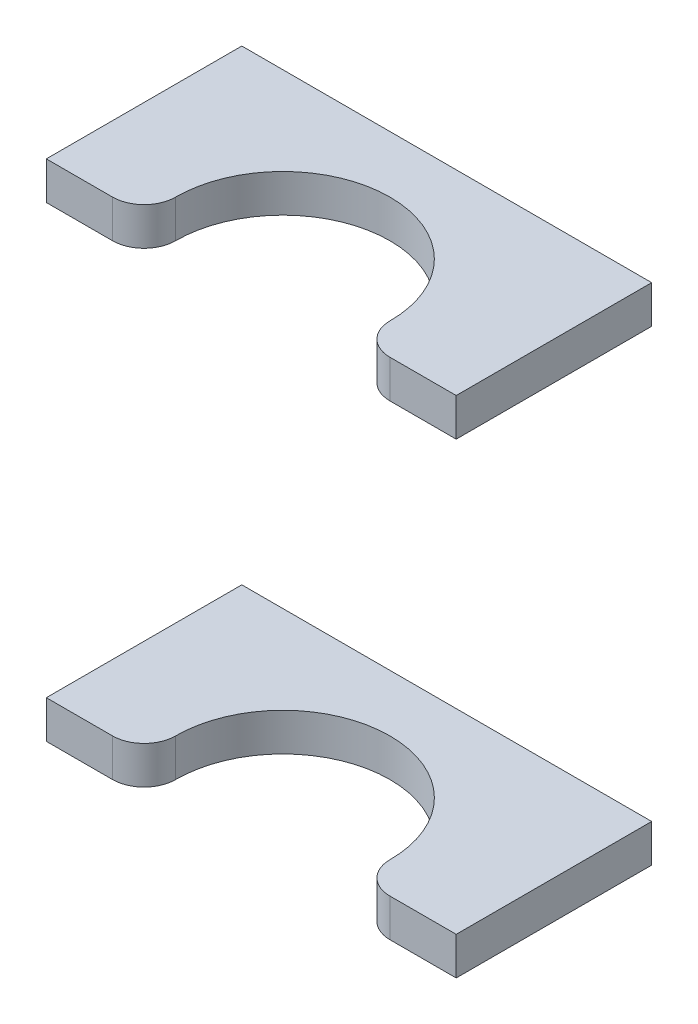
ISO-10303-21;
HEADER;
FILE_DESCRIPTION(('STEP AP214'),'2;1');
FILE_NAME('part.step','',(''),(''),'','','');
FILE_SCHEMA(('AUTOMOTIVE_DESIGN { 1 0 10303 214 1 1 1 1 }'));
ENDSEC;
DATA;
#1=APPLICATION_CONTEXT('core data for automotive mechanical design processes');
#2=APPLICATION_PROTOCOL_DEFINITION('international standard','automotive_design',2000,#1);
#3=PRODUCT_CONTEXT('',#1,'mechanical');
#4=PRODUCT('Part','Part','',(#3));
#5=PRODUCT_RELATED_PRODUCT_CATEGORY('part','',(#4));
#6=PRODUCT_DEFINITION_FORMATION('','',#4);
#7=PRODUCT_DEFINITION_CONTEXT('part definition',#1,'design');
#8=PRODUCT_DEFINITION('design','',#6,#7);
#9=PRODUCT_DEFINITION_SHAPE('','',#8);
#10=(LENGTH_UNIT() NAMED_UNIT(*) SI_UNIT(.MILLI.,.METRE.));
#11=(NAMED_UNIT(*) PLANE_ANGLE_UNIT() SI_UNIT($,.RADIAN.));
#12=(NAMED_UNIT(*) SI_UNIT($,.STERADIAN.) SOLID_ANGLE_UNIT());
#13=UNCERTAINTY_MEASURE_WITH_UNIT(LENGTH_MEASURE(1.E-05),#10,'distance_accuracy_value','');
#14=(GEOMETRIC_REPRESENTATION_CONTEXT(3) GLOBAL_UNCERTAINTY_ASSIGNED_CONTEXT((#13)) GLOBAL_UNIT_ASSIGNED_CONTEXT((#10,
#11,#12)) REPRESENTATION_CONTEXT('',''));
#15=CARTESIAN_POINT('',(0.,0.,0.));
#16=DIRECTION('',(0.,0.,1.));
#17=DIRECTION('',(1.,0.,0.));
#18=AXIS2_PLACEMENT_3D('',#15,#16,#17);
#19=CARTESIAN_POINT('',(-315.,100.,111.27633568147));
#20=DIRECTION('',(-1.,0.,0.));
#21=DIRECTION('',(0.,0.,1.));
#22=AXIS2_PLACEMENT_3D('',#19,#20,#21);
#23=PLANE('',#22);
#24=DIRECTION('',(0.,0.,-1.));
#25=VECTOR('',#24,1.);
#26=CARTESIAN_POINT('',(-315.,100.,111.27633568147));
#27=LINE('',#26,#25);
#28=CARTESIAN_POINT('',(-315.,100.,30.9999999999993));
#29=VERTEX_POINT('',#28);
#30=CARTESIAN_POINT('',(-315.,100.,0.));
#31=VERTEX_POINT('',#30);
#32=EDGE_CURVE('E86',#29,#31,#27,.T.);
#33=ORIENTED_EDGE('',*,*,#32,.F.);
#34=DIRECTION('',(0.,-1.,0.));
#35=VECTOR('',#34,1.);
#36=CARTESIAN_POINT('',(-315.,100.,30.9999999999993));
#37=LINE('',#36,#35);
#38=CARTESIAN_POINT('',(-315.,94.,30.9999999999993));
#39=VERTEX_POINT('',#38);
#40=EDGE_CURVE('E139',#29,#39,#37,.T.);
#41=ORIENTED_EDGE('',*,*,#40,.T.);
#42=DIRECTION('',(0.,0.,-1.));
#43=VECTOR('',#42,1.);
#44=CARTESIAN_POINT('',(-315.,94.,111.27633568147));
#45=LINE('',#44,#43);
#46=CARTESIAN_POINT('',(-315.,94.,0.));
#47=VERTEX_POINT('',#46);
#48=EDGE_CURVE('E94',#39,#47,#45,.T.);
#49=ORIENTED_EDGE('',*,*,#48,.T.);
#50=DIRECTION('',(0.,1.,0.));
#51=VECTOR('',#50,1.);
#52=CARTESIAN_POINT('',(-315.,100.,0.));
#53=LINE('',#52,#51);
#54=EDGE_CURVE('E190',#47,#31,#53,.T.);
#55=ORIENTED_EDGE('',*,*,#54,.T.);
#56=EDGE_LOOP('',(#33,#41,#49,#55));
#57=FACE_BOUND('',#56,.T.);
#58=ADVANCED_FACE('F50',(#57),#23,.F.);
#59=CARTESIAN_POINT('',(-315.,100.,111.27633568147));
#60=DIRECTION('',(0.,-1.,0.));
#61=DIRECTION('',(0.,0.,-1.));
#62=AXIS2_PLACEMENT_3D('',#59,#60,#61);
#63=PLANE('',#62);
#64=DIRECTION('',(0.,0.,-1.));
#65=VECTOR('',#64,1.);
#66=CARTESIAN_POINT('',(-380.,100.,111.27633568147));
#67=LINE('',#66,#65);
#68=CARTESIAN_POINT('',(-380.,100.,30.9999999999993));
#69=VERTEX_POINT('',#68);
#70=CARTESIAN_POINT('',(-380.,100.,0.));
#71=VERTEX_POINT('',#70);
#72=EDGE_CURVE('E186',#69,#71,#67,.T.);
#73=ORIENTED_EDGE('',*,*,#72,.F.);
#74=DIRECTION('',(1.,0.,0.));
#75=VECTOR('',#74,1.);
#76=CARTESIAN_POINT('',(-369.5,100.,30.9999999999995));
#77=LINE('',#76,#75);
#78=CARTESIAN_POINT('',(-369.5,100.,30.9999999999995));
#79=VERTEX_POINT('',#78);
#80=EDGE_CURVE('E145',#69,#79,#77,.T.);
#81=ORIENTED_EDGE('',*,*,#80,.T.);
#82=CARTESIAN_POINT('',(-369.5,100.,25.9999999999994));
#83=DIRECTION('',(0.,1.,0.));
#84=DIRECTION('',(1.,0.,0.));
#85=AXIS2_PLACEMENT_3D('',#82,#83,#84);
#86=CIRCLE('',#85,4.99999999999998);
#87=CARTESIAN_POINT('',(-364.5,100.,25.9999999999994));
#88=VERTEX_POINT('',#87);
#89=EDGE_CURVE('E159',#79,#88,#86,.T.);
#90=ORIENTED_EDGE('',*,*,#89,.T.);
#91=CARTESIAN_POINT('',(-347.5,100.,25.9999999999994));
#92=DIRECTION('',(0.,-1.,0.));
#93=DIRECTION('',(1.,0.,0.));
#94=AXIS2_PLACEMENT_3D('',#91,#92,#93);
#95=CIRCLE('',#94,17.);
#96=CARTESIAN_POINT('',(-330.5,100.,25.9999999999994));
#97=VERTEX_POINT('',#96);
#98=EDGE_CURVE('E140',#88,#97,#95,.T.);
#99=ORIENTED_EDGE('',*,*,#98,.T.);
#100=CARTESIAN_POINT('',(-325.5,100.,25.9999999999994));
#101=DIRECTION('',(0.,1.,0.));
#102=DIRECTION('',(-1.,0.,0.));
#103=AXIS2_PLACEMENT_3D('',#100,#101,#102);
#104=CIRCLE('',#103,4.99999999999998);
#105=CARTESIAN_POINT('',(-325.5,100.,30.9999999999995));
#106=VERTEX_POINT('',#105);
#107=EDGE_CURVE('E133',#97,#106,#104,.T.);
#108=ORIENTED_EDGE('',*,*,#107,.T.);
#109=DIRECTION('',(1.,0.,0.));
#110=VECTOR('',#109,1.);
#111=CARTESIAN_POINT('',(-325.5,100.,30.9999999999995));
#112=LINE('',#111,#110);
#113=EDGE_CURVE('E142',#106,#29,#112,.T.);
#114=ORIENTED_EDGE('',*,*,#113,.T.);
#115=ORIENTED_EDGE('',*,*,#32,.T.);
#116=DIRECTION('',(-1.,0.,0.));
#117=VECTOR('',#116,1.);
#118=CARTESIAN_POINT('',(-315.,100.,0.));
#119=LINE('',#118,#117);
#120=EDGE_CURVE('E187',#31,#71,#119,.T.);
#121=ORIENTED_EDGE('',*,*,#120,.T.);
#122=EDGE_LOOP('',(#73,#81,#90,#99,#108,#114,#115,#121));
#123=FACE_BOUND('',#122,.T.);
#124=ADVANCED_FACE('F148',(#123),#63,.F.);
#125=CARTESIAN_POINT('',(-380.,100.,111.27633568147));
#126=DIRECTION('',(1.,0.,0.));
#127=DIRECTION('',(0.,1.,0.));
#128=AXIS2_PLACEMENT_3D('',#125,#126,#127);
#129=PLANE('',#128);
#130=DIRECTION('',(0.,0.,-1.));
#131=VECTOR('',#130,1.);
#132=CARTESIAN_POINT('',(-380.,94.,111.27633568147));
#133=LINE('',#132,#131);
#134=CARTESIAN_POINT('',(-380.,94.,30.9999999999993));
#135=VERTEX_POINT('',#134);
#136=CARTESIAN_POINT('',(-380.,94.,0.));
#137=VERTEX_POINT('',#136);
#138=EDGE_CURVE('E73',#135,#137,#133,.T.);
#139=ORIENTED_EDGE('',*,*,#138,.F.);
#140=DIRECTION('',(0.,-1.,0.));
#141=VECTOR('',#140,1.);
#142=CARTESIAN_POINT('',(-380.,100.,30.9999999999993));
#143=LINE('',#142,#141);
#144=EDGE_CURVE('E174',#69,#135,#143,.T.);
#145=ORIENTED_EDGE('',*,*,#144,.F.);
#146=ORIENTED_EDGE('',*,*,#72,.T.);
#147=DIRECTION('',(0.,-1.,0.));
#148=VECTOR('',#147,1.);
#149=CARTESIAN_POINT('',(-380.,100.,0.));
#150=LINE('',#149,#148);
#151=EDGE_CURVE('E183',#71,#137,#150,.T.);
#152=ORIENTED_EDGE('',*,*,#151,.T.);
#153=EDGE_LOOP('',(#139,#145,#146,#152));
#154=FACE_BOUND('',#153,.T.);
#155=ADVANCED_FACE('F215',(#154),#129,.F.);
#156=CARTESIAN_POINT('',(-315.,94.,111.27633568147));
#157=DIRECTION('',(0.,1.,0.));
#158=DIRECTION('',(-1.,0.,0.));
#159=AXIS2_PLACEMENT_3D('',#156,#157,#158);
#160=PLANE('',#159);
#161=CARTESIAN_POINT('',(-369.5,94.,25.9999999999994));
#162=DIRECTION('',(0.,1.,0.));
#163=DIRECTION('',(-1.,0.,0.));
#164=AXIS2_PLACEMENT_3D('',#161,#162,#163);
#165=CIRCLE('',#164,4.99999999999998);
#166=CARTESIAN_POINT('',(-364.5,94.,25.9999999999994));
#167=VERTEX_POINT('',#166);
#168=CARTESIAN_POINT('',(-369.5,94.,30.9999999999995));
#169=VERTEX_POINT('',#168);
#170=EDGE_CURVE('E58',#167,#169,#165,.F.);
#171=ORIENTED_EDGE('',*,*,#170,.T.);
#172=DIRECTION('',(-1.,0.,0.));
#173=VECTOR('',#172,1.);
#174=CARTESIAN_POINT('',(-314.999999999999,94.,31.0000000000001));
#175=LINE('',#174,#173);
#176=EDGE_CURVE('E12',#169,#135,#175,.T.);
#177=ORIENTED_EDGE('',*,*,#176,.T.);
#178=ORIENTED_EDGE('',*,*,#138,.T.);
#179=DIRECTION('',(1.,0.,0.));
#180=VECTOR('',#179,1.);
#181=CARTESIAN_POINT('',(-315.,94.,0.));
#182=LINE('',#181,#180);
#183=EDGE_CURVE('E179',#137,#47,#182,.T.);
#184=ORIENTED_EDGE('',*,*,#183,.T.);
#185=ORIENTED_EDGE('',*,*,#48,.F.);
#186=DIRECTION('',(-1.,0.,0.));
#187=VECTOR('',#186,1.);
#188=CARTESIAN_POINT('',(-315.000000000001,94.,30.9999999999993));
#189=LINE('',#188,#187);
#190=CARTESIAN_POINT('',(-325.5,94.,30.9999999999995));
#191=VERTEX_POINT('',#190);
#192=EDGE_CURVE('E182',#39,#191,#189,.T.);
#193=ORIENTED_EDGE('',*,*,#192,.T.);
#194=CARTESIAN_POINT('',(-325.5,94.,25.9999999999994));
#195=DIRECTION('',(0.,1.,0.));
#196=DIRECTION('',(-1.,0.,0.));
#197=AXIS2_PLACEMENT_3D('',#194,#195,#196);
#198=CIRCLE('',#197,4.99999999999998);
#199=CARTESIAN_POINT('',(-330.5,94.,25.9999999999994));
#200=VERTEX_POINT('',#199);
#201=EDGE_CURVE('E136',#191,#200,#198,.F.);
#202=ORIENTED_EDGE('',*,*,#201,.T.);
#203=CARTESIAN_POINT('',(-347.5,94.,25.9999999999994));
#204=DIRECTION('',(0.,1.,0.));
#205=DIRECTION('',(-1.,0.,0.));
#206=AXIS2_PLACEMENT_3D('',#203,#204,#205);
#207=CIRCLE('',#206,17.);
#208=EDGE_CURVE('E101',#200,#167,#207,.T.);
#209=ORIENTED_EDGE('',*,*,#208,.T.);
#210=EDGE_LOOP('',(#171,#177,#178,#184,#185,#193,#202,#209));
#211=FACE_BOUND('',#210,.T.);
#212=ADVANCED_FACE('F206',(#211),#160,.F.);
#213=CARTESIAN_POINT('',(0.,0.,0.));
#214=DIRECTION('',(0.,0.,-1.));
#215=DIRECTION('',(-1.,0.,0.));
#216=AXIS2_PLACEMENT_3D('',#213,#214,#215);
#217=PLANE('',#216);
#218=ORIENTED_EDGE('',*,*,#54,.F.);
#219=ORIENTED_EDGE('',*,*,#183,.F.);
#220=ORIENTED_EDGE('',*,*,#151,.F.);
#221=ORIENTED_EDGE('',*,*,#120,.F.);
#222=EDGE_LOOP('',(#218,#219,#220,#221));
#223=FACE_BOUND('',#222,.T.);
#224=ADVANCED_FACE('F220',(#223),#217,.T.);
#225=CARTESIAN_POINT('',(-325.5,100.,25.9999999999994));
#226=DIRECTION('',(0.,-1.,0.));
#227=DIRECTION('',(1.,0.,0.));
#228=AXIS2_PLACEMENT_3D('',#225,#226,#227);
#229=CYLINDRICAL_SURFACE('',#228,4.99999999999998);
#230=DIRECTION('',(0.,-1.,0.));
#231=VECTOR('',#230,1.);
#232=CARTESIAN_POINT('',(-325.5,100.,30.9999999999995));
#233=LINE('',#232,#231);
#234=EDGE_CURVE('E65',#106,#191,#233,.T.);
#235=ORIENTED_EDGE('',*,*,#234,.F.);
#236=ORIENTED_EDGE('',*,*,#107,.F.);
#237=DIRECTION('',(0.,-1.,0.));
#238=VECTOR('',#237,1.);
#239=CARTESIAN_POINT('',(-330.5,100.,25.9999999999994));
#240=LINE('',#239,#238);
#241=EDGE_CURVE('E164',#97,#200,#240,.T.);
#242=ORIENTED_EDGE('',*,*,#241,.T.);
#243=ORIENTED_EDGE('',*,*,#201,.F.);
#244=EDGE_LOOP('',(#235,#236,#242,#243));
#245=FACE_BOUND('',#244,.T.);
#246=ADVANCED_FACE('F131',(#245),#229,.T.);
#247=CARTESIAN_POINT('',(-347.5,100.,25.9999999999994));
#248=DIRECTION('',(0.,-1.,0.));
#249=DIRECTION('',(1.,0.,0.));
#250=AXIS2_PLACEMENT_3D('',#247,#248,#249);
#251=CYLINDRICAL_SURFACE('',#250,17.);
#252=ORIENTED_EDGE('',*,*,#241,.F.);
#253=ORIENTED_EDGE('',*,*,#98,.F.);
#254=DIRECTION('',(0.,-1.,0.));
#255=VECTOR('',#254,1.);
#256=CARTESIAN_POINT('',(-364.5,100.,25.9999999999994));
#257=LINE('',#256,#255);
#258=EDGE_CURVE('E167',#88,#167,#257,.T.);
#259=ORIENTED_EDGE('',*,*,#258,.T.);
#260=ORIENTED_EDGE('',*,*,#208,.F.);
#261=EDGE_LOOP('',(#252,#253,#259,#260));
#262=FACE_BOUND('',#261,.T.);
#263=ADVANCED_FACE('F210',(#262),#251,.F.);
#264=CARTESIAN_POINT('',(-369.5,100.,25.9999999999994));
#265=DIRECTION('',(0.,-1.,0.));
#266=DIRECTION('',(1.,0.,0.));
#267=AXIS2_PLACEMENT_3D('',#264,#265,#266);
#268=CYLINDRICAL_SURFACE('',#267,4.99999999999998);
#269=ORIENTED_EDGE('',*,*,#258,.F.);
#270=ORIENTED_EDGE('',*,*,#89,.F.);
#271=DIRECTION('',(0.,-1.,0.));
#272=VECTOR('',#271,1.);
#273=CARTESIAN_POINT('',(-369.5,100.,30.9999999999995));
#274=LINE('',#273,#272);
#275=EDGE_CURVE('E170',#79,#169,#274,.T.);
#276=ORIENTED_EDGE('',*,*,#275,.T.);
#277=ORIENTED_EDGE('',*,*,#170,.F.);
#278=EDGE_LOOP('',(#269,#270,#276,#277));
#279=FACE_BOUND('',#278,.T.);
#280=ADVANCED_FACE('F208',(#279),#268,.T.);
#281=CARTESIAN_POINT('',(-369.5,100.,30.9999999999995));
#282=DIRECTION('',(0.,0.,-1.));
#283=DIRECTION('',(-1.,0.,0.));
#284=AXIS2_PLACEMENT_3D('',#281,#282,#283);
#285=PLANE('',#284);
#286=ORIENTED_EDGE('',*,*,#275,.F.);
#287=ORIENTED_EDGE('',*,*,#80,.F.);
#288=ORIENTED_EDGE('',*,*,#144,.T.);
#289=ORIENTED_EDGE('',*,*,#176,.F.);
#290=EDGE_LOOP('',(#286,#287,#288,#289));
#291=FACE_BOUND('',#290,.T.);
#292=ADVANCED_FACE('F213',(#291),#285,.F.);
#293=CARTESIAN_POINT('',(-325.5,100.,30.9999999999995));
#294=DIRECTION('',(0.,0.,-1.));
#295=DIRECTION('',(-1.,0.,0.));
#296=AXIS2_PLACEMENT_3D('',#293,#294,#295);
#297=PLANE('',#296);
#298=ORIENTED_EDGE('',*,*,#40,.F.);
#299=ORIENTED_EDGE('',*,*,#113,.F.);
#300=ORIENTED_EDGE('',*,*,#234,.T.);
#301=ORIENTED_EDGE('',*,*,#192,.F.);
#302=EDGE_LOOP('',(#298,#299,#300,#301));
#303=FACE_BOUND('',#302,.T.);
#304=ADVANCED_FACE('F143',(#303),#297,.F.);
#305=CLOSED_SHELL('',(#58,#124,#155,#212,#224,#246,#263,#280,#292,#304));
#306=MANIFOLD_SOLID_BREP('B2',#305);
#307=CARTESIAN_POINT('',(-380.,20.,111.27633568147));
#308=DIRECTION('',(1.,0.,0.));
#309=DIRECTION('',(0.,1.,0.));
#310=AXIS2_PLACEMENT_3D('',#307,#308,#309);
#311=PLANE('',#310);
#312=DIRECTION('',(0.,0.,-1.));
#313=VECTOR('',#312,1.);
#314=CARTESIAN_POINT('',(-380.,20.,111.27633568147));
#315=LINE('',#314,#313);
#316=CARTESIAN_POINT('',(-380.,20.,30.9999999999995));
#317=VERTEX_POINT('',#316);
#318=CARTESIAN_POINT('',(-380.,20.,0.));
#319=VERTEX_POINT('',#318);
#320=EDGE_CURVE('E347',#317,#319,#315,.T.);
#321=ORIENTED_EDGE('',*,*,#320,.F.);
#322=DIRECTION('',(0.,-1.,0.));
#323=VECTOR('',#322,1.);
#324=CARTESIAN_POINT('',(-380.,100.,30.9999999999995));
#325=LINE('',#324,#323);
#326=CARTESIAN_POINT('',(-380.,26.,30.9999999999995));
#327=VERTEX_POINT('',#326);
#328=EDGE_CURVE('E433',#327,#317,#325,.T.);
#329=ORIENTED_EDGE('',*,*,#328,.F.);
#330=DIRECTION('',(0.,0.,-1.));
#331=VECTOR('',#330,1.);
#332=CARTESIAN_POINT('',(-380.,26.,111.27633568147));
#333=LINE('',#332,#331);
#334=CARTESIAN_POINT('',(-380.,26.,0.));
#335=VERTEX_POINT('',#334);
#336=EDGE_CURVE('E355',#327,#335,#333,.T.);
#337=ORIENTED_EDGE('',*,*,#336,.T.);
#338=DIRECTION('',(0.,-1.,0.));
#339=VECTOR('',#338,1.);
#340=CARTESIAN_POINT('',(-380.,20.,0.));
#341=LINE('',#340,#339);
#342=EDGE_CURVE('E447',#335,#319,#341,.T.);
#343=ORIENTED_EDGE('',*,*,#342,.T.);
#344=EDGE_LOOP('',(#321,#329,#337,#343));
#345=FACE_BOUND('',#344,.T.);
#346=ADVANCED_FACE('F311',(#345),#311,.F.);
#347=CARTESIAN_POINT('',(-315.,20.,111.27633568147));
#348=DIRECTION('',(0.,1.,0.));
#349=DIRECTION('',(0.,0.,1.));
#350=AXIS2_PLACEMENT_3D('',#347,#348,#349);
#351=PLANE('',#350);
#352=CARTESIAN_POINT('',(-369.5,20.,25.9999999999996));
#353=DIRECTION('',(0.,1.,0.));
#354=DIRECTION('',(1.,0.,0.));
#355=AXIS2_PLACEMENT_3D('',#352,#353,#354);
#356=CIRCLE('',#355,4.99999999999998);
#357=CARTESIAN_POINT('',(-369.5,20.,30.9999999999995));
#358=VERTEX_POINT('',#357);
#359=CARTESIAN_POINT('',(-364.5,20.,25.9999999999996));
#360=VERTEX_POINT('',#359);
#361=EDGE_CURVE('E417',#358,#360,#356,.T.);
#362=ORIENTED_EDGE('',*,*,#361,.F.);
#363=DIRECTION('',(1.,0.,0.));
#364=VECTOR('',#363,1.);
#365=CARTESIAN_POINT('',(-369.5,20.,30.9999999999995));
#366=LINE('',#365,#364);
#367=EDGE_CURVE('E412',#317,#358,#366,.T.);
#368=ORIENTED_EDGE('',*,*,#367,.F.);
#369=ORIENTED_EDGE('',*,*,#320,.T.);
#370=DIRECTION('',(1.,0.,0.));
#371=VECTOR('',#370,1.);
#372=CARTESIAN_POINT('',(-315.,20.,0.));
#373=LINE('',#372,#371);
#374=CARTESIAN_POINT('',(-315.,20.,0.));
#375=VERTEX_POINT('',#374);
#376=EDGE_CURVE('E444',#319,#375,#373,.T.);
#377=ORIENTED_EDGE('',*,*,#376,.T.);
#378=DIRECTION('',(0.,0.,-1.));
#379=VECTOR('',#378,1.);
#380=CARTESIAN_POINT('',(-315.,20.,111.27633568147));
#381=LINE('',#380,#379);
#382=CARTESIAN_POINT('',(-315.,20.,30.9999999999995));
#383=VERTEX_POINT('',#382);
#384=EDGE_CURVE('E410',#383,#375,#381,.T.);
#385=ORIENTED_EDGE('',*,*,#384,.F.);
#386=DIRECTION('',(1.,0.,0.));
#387=VECTOR('',#386,1.);
#388=CARTESIAN_POINT('',(-325.5,20.,30.9999999999995));
#389=LINE('',#388,#387);
#390=CARTESIAN_POINT('',(-325.5,20.,30.9999999999995));
#391=VERTEX_POINT('',#390);
#392=EDGE_CURVE('E394',#391,#383,#389,.T.);
#393=ORIENTED_EDGE('',*,*,#392,.F.);
#394=CARTESIAN_POINT('',(-325.5,20.,25.9999999999996));
#395=DIRECTION('',(0.,1.,0.));
#396=DIRECTION('',(-1.,0.,0.));
#397=AXIS2_PLACEMENT_3D('',#394,#395,#396);
#398=CIRCLE('',#397,4.99999999999998);
#399=CARTESIAN_POINT('',(-330.5,20.,25.9999999999994));
#400=VERTEX_POINT('',#399);
#401=EDGE_CURVE('E400',#400,#391,#398,.T.);
#402=ORIENTED_EDGE('',*,*,#401,.F.);
#403=CARTESIAN_POINT('',(-347.5,20.,25.9999999999994));
#404=DIRECTION('',(0.,-1.,0.));
#405=DIRECTION('',(1.,0.,0.));
#406=AXIS2_PLACEMENT_3D('',#403,#404,#405);
#407=CIRCLE('',#406,17.);
#408=EDGE_CURVE('E397',#360,#400,#407,.T.);
#409=ORIENTED_EDGE('',*,*,#408,.F.);
#410=EDGE_LOOP('',(#362,#368,#369,#377,#385,#393,#402,#409));
#411=FACE_BOUND('',#410,.T.);
#412=ADVANCED_FACE('F409',(#411),#351,.F.);
#413=CARTESIAN_POINT('',(-315.,20.,111.27633568147));
#414=DIRECTION('',(-1.,0.,0.));
#415=DIRECTION('',(0.,0.,1.));
#416=AXIS2_PLACEMENT_3D('',#413,#414,#415);
#417=PLANE('',#416);
#418=DIRECTION('',(0.,0.,-1.));
#419=VECTOR('',#418,1.);
#420=CARTESIAN_POINT('',(-315.,26.,111.27633568147));
#421=LINE('',#420,#419);
#422=CARTESIAN_POINT('',(-315.,26.,30.9999999999995));
#423=VERTEX_POINT('',#422);
#424=CARTESIAN_POINT('',(-315.,26.,0.));
#425=VERTEX_POINT('',#424);
#426=EDGE_CURVE('E334',#423,#425,#421,.T.);
#427=ORIENTED_EDGE('',*,*,#426,.F.);
#428=DIRECTION('',(0.,-1.,0.));
#429=VECTOR('',#428,1.);
#430=CARTESIAN_POINT('',(-315.,100.,30.9999999999995));
#431=LINE('',#430,#429);
#432=EDGE_CURVE('E326',#423,#383,#431,.T.);
#433=ORIENTED_EDGE('',*,*,#432,.T.);
#434=ORIENTED_EDGE('',*,*,#384,.T.);
#435=DIRECTION('',(0.,1.,0.));
#436=VECTOR('',#435,1.);
#437=CARTESIAN_POINT('',(-315.,20.,0.));
#438=LINE('',#437,#436);
#439=EDGE_CURVE('E441',#375,#425,#438,.T.);
#440=ORIENTED_EDGE('',*,*,#439,.T.);
#441=EDGE_LOOP('',(#427,#433,#434,#440));
#442=FACE_BOUND('',#441,.T.);
#443=ADVANCED_FACE('F488',(#442),#417,.F.);
#444=CARTESIAN_POINT('',(-315.,26.,111.27633568147));
#445=DIRECTION('',(0.,-1.,0.));
#446=DIRECTION('',(1.,0.,0.));
#447=AXIS2_PLACEMENT_3D('',#444,#445,#446);
#448=PLANE('',#447);
#449=ORIENTED_EDGE('',*,*,#336,.F.);
#450=DIRECTION('',(1.,0.,0.));
#451=VECTOR('',#450,1.);
#452=CARTESIAN_POINT('',(-314.999999999999,26.,30.9999999999999));
#453=LINE('',#452,#451);
#454=CARTESIAN_POINT('',(-369.5,26.,30.9999999999995));
#455=VERTEX_POINT('',#454);
#456=EDGE_CURVE('E48',#327,#455,#453,.T.);
#457=ORIENTED_EDGE('',*,*,#456,.T.);
#458=CARTESIAN_POINT('',(-369.5,26.,25.9999999999996));
#459=DIRECTION('',(0.,-1.,0.));
#460=DIRECTION('',(1.,0.,0.));
#461=AXIS2_PLACEMENT_3D('',#458,#459,#460);
#462=CIRCLE('',#461,4.99999999999998);
#463=CARTESIAN_POINT('',(-364.5,26.,25.9999999999996));
#464=VERTEX_POINT('',#463);
#465=EDGE_CURVE('E319',#455,#464,#462,.F.);
#466=ORIENTED_EDGE('',*,*,#465,.T.);
#467=CARTESIAN_POINT('',(-347.5,26.,25.9999999999994));
#468=DIRECTION('',(0.,-1.,0.));
#469=DIRECTION('',(1.,0.,0.));
#470=AXIS2_PLACEMENT_3D('',#467,#468,#469);
#471=CIRCLE('',#470,17.);
#472=CARTESIAN_POINT('',(-330.5,26.,25.9999999999994));
#473=VERTEX_POINT('',#472);
#474=EDGE_CURVE('E461',#464,#473,#471,.T.);
#475=ORIENTED_EDGE('',*,*,#474,.T.);
#476=CARTESIAN_POINT('',(-325.5,26.,25.9999999999996));
#477=DIRECTION('',(0.,-1.,0.));
#478=DIRECTION('',(1.,0.,0.));
#479=AXIS2_PLACEMENT_3D('',#476,#477,#478);
#480=CIRCLE('',#479,4.99999999999998);
#481=CARTESIAN_POINT('',(-325.5,26.,30.9999999999995));
#482=VERTEX_POINT('',#481);
#483=EDGE_CURVE('E362',#473,#482,#480,.F.);
#484=ORIENTED_EDGE('',*,*,#483,.T.);
#485=DIRECTION('',(1.,0.,0.));
#486=VECTOR('',#485,1.);
#487=CARTESIAN_POINT('',(-315.000000000001,26.,30.9999999999995));
#488=LINE('',#487,#486);
#489=EDGE_CURVE('E395',#482,#423,#488,.T.);
#490=ORIENTED_EDGE('',*,*,#489,.T.);
#491=ORIENTED_EDGE('',*,*,#426,.T.);
#492=DIRECTION('',(-1.,0.,0.));
#493=VECTOR('',#492,1.);
#494=CARTESIAN_POINT('',(-315.,26.,0.));
#495=LINE('',#494,#493);
#496=EDGE_CURVE('E438',#425,#335,#495,.T.);
#497=ORIENTED_EDGE('',*,*,#496,.T.);
#498=EDGE_LOOP('',(#449,#457,#466,#475,#484,#490,#491,#497));
#499=FACE_BOUND('',#498,.T.);
#500=ADVANCED_FACE('F466',(#499),#448,.F.);
#501=CARTESIAN_POINT('',(0.,0.,0.));
#502=DIRECTION('',(0.,0.,1.));
#503=DIRECTION('',(1.,0.,0.));
#504=AXIS2_PLACEMENT_3D('',#501,#502,#503);
#505=PLANE('',#504);
#506=ORIENTED_EDGE('',*,*,#342,.F.);
#507=ORIENTED_EDGE('',*,*,#496,.F.);
#508=ORIENTED_EDGE('',*,*,#439,.F.);
#509=ORIENTED_EDGE('',*,*,#376,.F.);
#510=EDGE_LOOP('',(#506,#507,#508,#509));
#511=FACE_BOUND('',#510,.T.);
#512=ADVANCED_FACE('F482',(#511),#505,.F.);
#513=CARTESIAN_POINT('',(-325.5,100.,25.9999999999996));
#514=DIRECTION('',(0.,-1.,0.));
#515=DIRECTION('',(1.,0.,0.));
#516=AXIS2_PLACEMENT_3D('',#513,#514,#515);
#517=CYLINDRICAL_SURFACE('',#516,4.99999999999998);
#518=DIRECTION('',(0.,-1.,0.));
#519=VECTOR('',#518,1.);
#520=CARTESIAN_POINT('',(-330.5,100.,25.9999999999994));
#521=LINE('',#520,#519);
#522=EDGE_CURVE('E402',#473,#400,#521,.T.);
#523=ORIENTED_EDGE('',*,*,#522,.T.);
#524=ORIENTED_EDGE('',*,*,#401,.T.);
#525=DIRECTION('',(0.,-1.,0.));
#526=VECTOR('',#525,1.);
#527=CARTESIAN_POINT('',(-325.5,100.,30.9999999999995));
#528=LINE('',#527,#526);
#529=EDGE_CURVE('E390',#482,#391,#528,.T.);
#530=ORIENTED_EDGE('',*,*,#529,.F.);
#531=ORIENTED_EDGE('',*,*,#483,.F.);
#532=EDGE_LOOP('',(#523,#524,#530,#531));
#533=FACE_BOUND('',#532,.T.);
#534=ADVANCED_FACE('F401',(#533),#517,.T.);
#535=CARTESIAN_POINT('',(-347.5,100.,25.9999999999994));
#536=DIRECTION('',(0.,-1.,0.));
#537=DIRECTION('',(1.,0.,0.));
#538=AXIS2_PLACEMENT_3D('',#535,#536,#537);
#539=CYLINDRICAL_SURFACE('',#538,17.);
#540=DIRECTION('',(0.,-1.,0.));
#541=VECTOR('',#540,1.);
#542=CARTESIAN_POINT('',(-364.5,100.,25.9999999999996));
#543=LINE('',#542,#541);
#544=EDGE_CURVE('E427',#464,#360,#543,.T.);
#545=ORIENTED_EDGE('',*,*,#544,.T.);
#546=ORIENTED_EDGE('',*,*,#408,.T.);
#547=ORIENTED_EDGE('',*,*,#522,.F.);
#548=ORIENTED_EDGE('',*,*,#474,.F.);
#549=EDGE_LOOP('',(#545,#546,#547,#548));
#550=FACE_BOUND('',#549,.T.);
#551=ADVANCED_FACE('F474',(#550),#539,.F.);
#552=CARTESIAN_POINT('',(-369.5,100.,25.9999999999996));
#553=DIRECTION('',(0.,-1.,0.));
#554=DIRECTION('',(1.,0.,0.));
#555=AXIS2_PLACEMENT_3D('',#552,#553,#554);
#556=CYLINDRICAL_SURFACE('',#555,4.99999999999998);
#557=DIRECTION('',(0.,-1.,0.));
#558=VECTOR('',#557,1.);
#559=CARTESIAN_POINT('',(-369.5,100.,30.9999999999995));
#560=LINE('',#559,#558);
#561=EDGE_CURVE('E430',#455,#358,#560,.T.);
#562=ORIENTED_EDGE('',*,*,#561,.T.);
#563=ORIENTED_EDGE('',*,*,#361,.T.);
#564=ORIENTED_EDGE('',*,*,#544,.F.);
#565=ORIENTED_EDGE('',*,*,#465,.F.);
#566=EDGE_LOOP('',(#562,#563,#564,#565));
#567=FACE_BOUND('',#566,.T.);
#568=ADVANCED_FACE('F470',(#567),#556,.T.);
#569=CARTESIAN_POINT('',(-369.5,100.,30.9999999999995));
#570=DIRECTION('',(0.,0.,-1.));
#571=DIRECTION('',(-1.,0.,0.));
#572=AXIS2_PLACEMENT_3D('',#569,#570,#571);
#573=PLANE('',#572);
#574=ORIENTED_EDGE('',*,*,#328,.T.);
#575=ORIENTED_EDGE('',*,*,#367,.T.);
#576=ORIENTED_EDGE('',*,*,#561,.F.);
#577=ORIENTED_EDGE('',*,*,#456,.F.);
#578=EDGE_LOOP('',(#574,#575,#576,#577));
#579=FACE_BOUND('',#578,.T.);
#580=ADVANCED_FACE('F472',(#579),#573,.F.);
#581=CARTESIAN_POINT('',(-325.5,100.,30.9999999999995));
#582=DIRECTION('',(0.,0.,-1.));
#583=DIRECTION('',(-1.,0.,0.));
#584=AXIS2_PLACEMENT_3D('',#581,#582,#583);
#585=PLANE('',#584);
#586=ORIENTED_EDGE('',*,*,#529,.T.);
#587=ORIENTED_EDGE('',*,*,#392,.T.);
#588=ORIENTED_EDGE('',*,*,#432,.F.);
#589=ORIENTED_EDGE('',*,*,#489,.F.);
#590=EDGE_LOOP('',(#586,#587,#588,#589));
#591=FACE_BOUND('',#590,.T.);
#592=ADVANCED_FACE('F392',(#591),#585,.F.);
#593=CLOSED_SHELL('',(#346,#412,#443,#500,#512,#534,#551,#568,#580,#592));
#594=MANIFOLD_SOLID_BREP('B6',#593);
#595=ADVANCED_BREP_SHAPE_REPRESENTATION('',(#18,#306,#594),#14);
#596=SHAPE_DEFINITION_REPRESENTATION(#9,#595);
ENDSEC;
END-ISO-10303-21;
